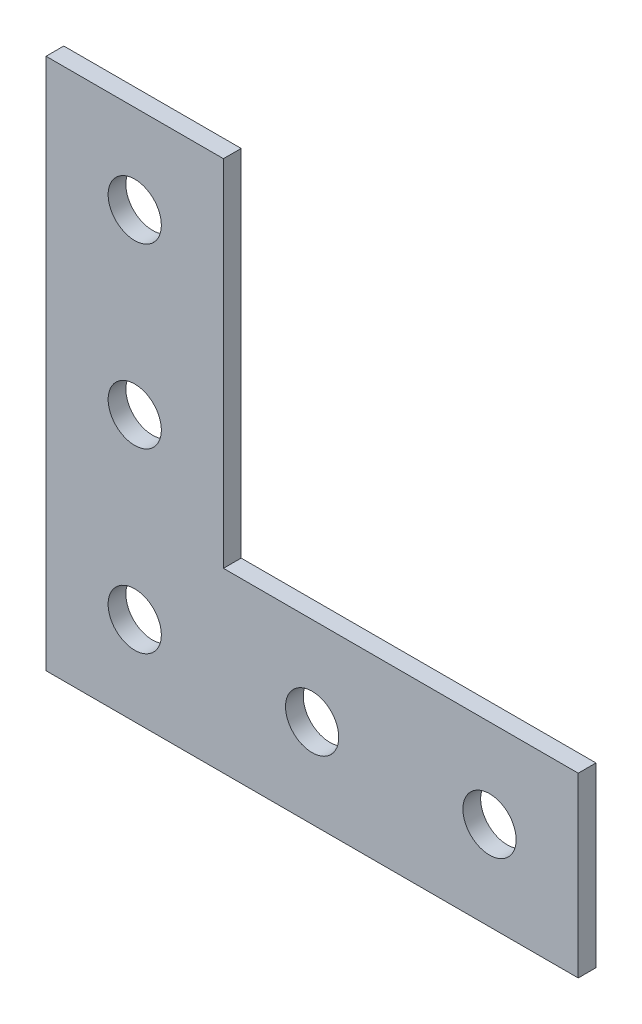
ISO-10303-21;
HEADER;
FILE_DESCRIPTION(('STEP AP214'),'2;1');
FILE_NAME('part.step','',(''),(''),'','','');
FILE_SCHEMA(('AUTOMOTIVE_DESIGN { 1 0 10303 214 1 1 1 1 }'));
ENDSEC;
DATA;
#1=APPLICATION_CONTEXT('core data for automotive mechanical design processes');
#2=APPLICATION_PROTOCOL_DEFINITION('international standard','automotive_design',2000,#1);
#3=PRODUCT_CONTEXT('',#1,'mechanical');
#4=PRODUCT('Part','Part','',(#3));
#5=PRODUCT_RELATED_PRODUCT_CATEGORY('part','',(#4));
#6=PRODUCT_DEFINITION_FORMATION('','',#4);
#7=PRODUCT_DEFINITION_CONTEXT('part definition',#1,'design');
#8=PRODUCT_DEFINITION('design','',#6,#7);
#9=PRODUCT_DEFINITION_SHAPE('','',#8);
#10=(LENGTH_UNIT() NAMED_UNIT(*) SI_UNIT(.MILLI.,.METRE.));
#11=(NAMED_UNIT(*) PLANE_ANGLE_UNIT() SI_UNIT($,.RADIAN.));
#12=(NAMED_UNIT(*) SI_UNIT($,.STERADIAN.) SOLID_ANGLE_UNIT());
#13=UNCERTAINTY_MEASURE_WITH_UNIT(LENGTH_MEASURE(1.E-05),#10,'distance_accuracy_value','');
#14=(GEOMETRIC_REPRESENTATION_CONTEXT(3) GLOBAL_UNCERTAINTY_ASSIGNED_CONTEXT((#13)) GLOBAL_UNIT_ASSIGNED_CONTEXT((#10,
#11,#12)) REPRESENTATION_CONTEXT('',''));
#15=CARTESIAN_POINT('',(0.,0.,0.));
#16=DIRECTION('',(0.,0.,1.));
#17=DIRECTION('',(1.,0.,0.));
#18=AXIS2_PLACEMENT_3D('',#15,#16,#17);
#19=CARTESIAN_POINT('',(0.,30.,1.));
#20=DIRECTION('',(1.,0.,0.));
#21=DIRECTION('',(0.,0.,-1.));
#22=AXIS2_PLACEMENT_3D('',#19,#20,#21);
#23=PLANE('',#22);
#24=DIRECTION('',(0.,-1.,0.));
#25=VECTOR('',#24,1.);
#26=CARTESIAN_POINT('',(0.,30.,0.));
#27=LINE('',#26,#25);
#28=CARTESIAN_POINT('',(0.,30.,0.));
#29=VERTEX_POINT('',#28);
#30=CARTESIAN_POINT('',(0.,0.,0.));
#31=VERTEX_POINT('',#30);
#32=EDGE_CURVE('E117',#29,#31,#27,.T.);
#33=ORIENTED_EDGE('',*,*,#32,.T.);
#34=DIRECTION('',(0.,0.,-1.));
#35=VECTOR('',#34,1.);
#36=CARTESIAN_POINT('',(0.,0.,1.));
#37=LINE('',#36,#35);
#38=CARTESIAN_POINT('',(0.,0.,1.));
#39=VERTEX_POINT('',#38);
#40=EDGE_CURVE('E11',#39,#31,#37,.T.);
#41=ORIENTED_EDGE('',*,*,#40,.F.);
#42=DIRECTION('',(0.,-1.,0.));
#43=VECTOR('',#42,1.);
#44=CARTESIAN_POINT('',(0.,30.,1.));
#45=LINE('',#44,#43);
#46=CARTESIAN_POINT('',(0.,30.,1.));
#47=VERTEX_POINT('',#46);
#48=EDGE_CURVE('E128',#47,#39,#45,.T.);
#49=ORIENTED_EDGE('',*,*,#48,.F.);
#50=DIRECTION('',(0.,0.,-1.));
#51=VECTOR('',#50,1.);
#52=CARTESIAN_POINT('',(0.,30.,1.));
#53=LINE('',#52,#51);
#54=EDGE_CURVE('E113',#47,#29,#53,.T.);
#55=ORIENTED_EDGE('',*,*,#54,.T.);
#56=EDGE_LOOP('',(#33,#41,#49,#55));
#57=FACE_BOUND('',#56,.T.);
#58=ADVANCED_FACE('F33',(#57),#23,.F.);
#59=CARTESIAN_POINT('',(0.,0.,1.));
#60=DIRECTION('',(0.,1.,0.));
#61=DIRECTION('',(-1.,0.,0.));
#62=AXIS2_PLACEMENT_3D('',#59,#60,#61);
#63=PLANE('',#62);
#64=DIRECTION('',(1.,0.,0.));
#65=VECTOR('',#64,1.);
#66=CARTESIAN_POINT('',(0.,0.,0.));
#67=LINE('',#66,#65);
#68=CARTESIAN_POINT('',(30.,0.,0.));
#69=VERTEX_POINT('',#68);
#70=EDGE_CURVE('E120',#31,#69,#67,.T.);
#71=ORIENTED_EDGE('',*,*,#70,.T.);
#72=DIRECTION('',(0.,0.,-1.));
#73=VECTOR('',#72,1.);
#74=CARTESIAN_POINT('',(30.,0.,1.));
#75=LINE('',#74,#73);
#76=CARTESIAN_POINT('',(30.,0.,1.));
#77=VERTEX_POINT('',#76);
#78=EDGE_CURVE('E41',#77,#69,#75,.T.);
#79=ORIENTED_EDGE('',*,*,#78,.F.);
#80=DIRECTION('',(1.,0.,0.));
#81=VECTOR('',#80,1.);
#82=CARTESIAN_POINT('',(0.,0.,1.));
#83=LINE('',#82,#81);
#84=EDGE_CURVE('E86',#39,#77,#83,.T.);
#85=ORIENTED_EDGE('',*,*,#84,.F.);
#86=ORIENTED_EDGE('',*,*,#40,.T.);
#87=EDGE_LOOP('',(#71,#79,#85,#86));
#88=FACE_BOUND('',#87,.T.);
#89=ADVANCED_FACE('F153',(#88),#63,.F.);
#90=CARTESIAN_POINT('',(30.,0.,1.));
#91=DIRECTION('',(-1.,0.,0.));
#92=DIRECTION('',(0.,0.,1.));
#93=AXIS2_PLACEMENT_3D('',#90,#91,#92);
#94=PLANE('',#93);
#95=DIRECTION('',(0.,1.,0.));
#96=VECTOR('',#95,1.);
#97=CARTESIAN_POINT('',(30.,0.,0.));
#98=LINE('',#97,#96);
#99=CARTESIAN_POINT('',(30.,10.,0.));
#100=VERTEX_POINT('',#99);
#101=EDGE_CURVE('E123',#69,#100,#98,.T.);
#102=ORIENTED_EDGE('',*,*,#101,.T.);
#103=DIRECTION('',(0.,0.,-1.));
#104=VECTOR('',#103,1.);
#105=CARTESIAN_POINT('',(30.,10.,1.));
#106=LINE('',#105,#104);
#107=CARTESIAN_POINT('',(30.,10.,1.));
#108=VERTEX_POINT('',#107);
#109=EDGE_CURVE('E108',#108,#100,#106,.T.);
#110=ORIENTED_EDGE('',*,*,#109,.F.);
#111=DIRECTION('',(0.,1.,0.));
#112=VECTOR('',#111,1.);
#113=CARTESIAN_POINT('',(30.,0.,1.));
#114=LINE('',#113,#112);
#115=EDGE_CURVE('E99',#77,#108,#114,.T.);
#116=ORIENTED_EDGE('',*,*,#115,.F.);
#117=ORIENTED_EDGE('',*,*,#78,.T.);
#118=EDGE_LOOP('',(#102,#110,#116,#117));
#119=FACE_BOUND('',#118,.T.);
#120=ADVANCED_FACE('F134',(#119),#94,.F.);
#121=CARTESIAN_POINT('',(30.,10.,1.));
#122=DIRECTION('',(0.,-1.,0.));
#123=DIRECTION('',(0.,0.,-1.));
#124=AXIS2_PLACEMENT_3D('',#121,#122,#123);
#125=PLANE('',#124);
#126=DIRECTION('',(-1.,0.,0.));
#127=VECTOR('',#126,1.);
#128=CARTESIAN_POINT('',(30.,10.,0.));
#129=LINE('',#128,#127);
#130=CARTESIAN_POINT('',(10.,10.,0.));
#131=VERTEX_POINT('',#130);
#132=EDGE_CURVE('E107',#100,#131,#129,.T.);
#133=ORIENTED_EDGE('',*,*,#132,.T.);
#134=DIRECTION('',(0.,0.,-1.));
#135=VECTOR('',#134,1.);
#136=CARTESIAN_POINT('',(10.,10.,1.));
#137=LINE('',#136,#135);
#138=CARTESIAN_POINT('',(10.,10.,1.));
#139=VERTEX_POINT('',#138);
#140=EDGE_CURVE('E104',#139,#131,#137,.T.);
#141=ORIENTED_EDGE('',*,*,#140,.F.);
#142=DIRECTION('',(-1.,0.,0.));
#143=VECTOR('',#142,1.);
#144=CARTESIAN_POINT('',(30.,10.,1.));
#145=LINE('',#144,#143);
#146=EDGE_CURVE('E93',#108,#139,#145,.T.);
#147=ORIENTED_EDGE('',*,*,#146,.F.);
#148=ORIENTED_EDGE('',*,*,#109,.T.);
#149=EDGE_LOOP('',(#133,#141,#147,#148));
#150=FACE_BOUND('',#149,.T.);
#151=ADVANCED_FACE('F105',(#150),#125,.F.);
#152=CARTESIAN_POINT('',(10.,10.,1.));
#153=DIRECTION('',(-1.,0.,0.));
#154=DIRECTION('',(0.,0.,1.));
#155=AXIS2_PLACEMENT_3D('',#152,#153,#154);
#156=PLANE('',#155);
#157=DIRECTION('',(0.,1.,0.));
#158=VECTOR('',#157,1.);
#159=CARTESIAN_POINT('',(10.,10.,0.));
#160=LINE('',#159,#158);
#161=CARTESIAN_POINT('',(10.,30.,0.));
#162=VERTEX_POINT('',#161);
#163=EDGE_CURVE('E72',#131,#162,#160,.T.);
#164=ORIENTED_EDGE('',*,*,#163,.T.);
#165=DIRECTION('',(0.,0.,-1.));
#166=VECTOR('',#165,1.);
#167=CARTESIAN_POINT('',(10.,30.,1.));
#168=LINE('',#167,#166);
#169=CARTESIAN_POINT('',(10.,30.,1.));
#170=VERTEX_POINT('',#169);
#171=EDGE_CURVE('E109',#170,#162,#168,.T.);
#172=ORIENTED_EDGE('',*,*,#171,.F.);
#173=DIRECTION('',(0.,1.,0.));
#174=VECTOR('',#173,1.);
#175=CARTESIAN_POINT('',(10.,10.,1.));
#176=LINE('',#175,#174);
#177=EDGE_CURVE('E97',#139,#170,#176,.T.);
#178=ORIENTED_EDGE('',*,*,#177,.F.);
#179=ORIENTED_EDGE('',*,*,#140,.T.);
#180=EDGE_LOOP('',(#164,#172,#178,#179));
#181=FACE_BOUND('',#180,.T.);
#182=ADVANCED_FACE('F111',(#181),#156,.F.);
#183=CARTESIAN_POINT('',(10.,30.,1.));
#184=DIRECTION('',(0.,-1.,0.));
#185=DIRECTION('',(0.,0.,-1.));
#186=AXIS2_PLACEMENT_3D('',#183,#184,#185);
#187=PLANE('',#186);
#188=DIRECTION('',(-1.,0.,0.));
#189=VECTOR('',#188,1.);
#190=CARTESIAN_POINT('',(10.,30.,0.));
#191=LINE('',#190,#189);
#192=EDGE_CURVE('E78',#162,#29,#191,.T.);
#193=ORIENTED_EDGE('',*,*,#192,.T.);
#194=ORIENTED_EDGE('',*,*,#54,.F.);
#195=DIRECTION('',(-1.,0.,0.));
#196=VECTOR('',#195,1.);
#197=CARTESIAN_POINT('',(10.,30.,1.));
#198=LINE('',#197,#196);
#199=EDGE_CURVE('E49',#170,#47,#198,.T.);
#200=ORIENTED_EDGE('',*,*,#199,.F.);
#201=ORIENTED_EDGE('',*,*,#171,.T.);
#202=EDGE_LOOP('',(#193,#194,#200,#201));
#203=FACE_BOUND('',#202,.T.);
#204=ADVANCED_FACE('F141',(#203),#187,.F.);
#205=CARTESIAN_POINT('',(0.,0.,1.));
#206=DIRECTION('',(0.,0.,1.));
#207=DIRECTION('',(1.,0.,0.));
#208=AXIS2_PLACEMENT_3D('',#205,#206,#207);
#209=PLANE('',#208);
#210=CARTESIAN_POINT('',(5.,25.,1.));
#211=DIRECTION('',(0.,0.,1.));
#212=DIRECTION('',(1.,0.,0.));
#213=AXIS2_PLACEMENT_3D('',#210,#211,#212);
#214=CIRCLE('',#213,1.5);
#215=CARTESIAN_POINT('',(6.5,25.,1.));
#216=VERTEX_POINT('',#215);
#217=EDGE_CURVE('E249',#216,#216,#214,.T.);
#218=ORIENTED_EDGE('',*,*,#217,.F.);
#219=EDGE_LOOP('',(#218));
#220=FACE_BOUND('',#219,.T.);
#221=CARTESIAN_POINT('',(5.,15.,1.));
#222=DIRECTION('',(0.,0.,1.));
#223=DIRECTION('',(1.,0.,0.));
#224=AXIS2_PLACEMENT_3D('',#221,#222,#223);
#225=CIRCLE('',#224,1.5);
#226=CARTESIAN_POINT('',(6.5,15.,1.));
#227=VERTEX_POINT('',#226);
#228=EDGE_CURVE('E255',#227,#227,#225,.T.);
#229=ORIENTED_EDGE('',*,*,#228,.F.);
#230=EDGE_LOOP('',(#229));
#231=FACE_BOUND('',#230,.T.);
#232=CARTESIAN_POINT('',(15.,5.,1.));
#233=DIRECTION('',(0.,0.,1.));
#234=DIRECTION('',(1.,0.,0.));
#235=AXIS2_PLACEMENT_3D('',#232,#233,#234);
#236=CIRCLE('',#235,1.5);
#237=CARTESIAN_POINT('',(16.5,5.,1.));
#238=VERTEX_POINT('',#237);
#239=EDGE_CURVE('E263',#238,#238,#236,.T.);
#240=ORIENTED_EDGE('',*,*,#239,.F.);
#241=EDGE_LOOP('',(#240));
#242=FACE_BOUND('',#241,.T.);
#243=CARTESIAN_POINT('',(25.,5.,1.));
#244=DIRECTION('',(0.,0.,1.));
#245=DIRECTION('',(1.,0.,0.));
#246=AXIS2_PLACEMENT_3D('',#243,#244,#245);
#247=CIRCLE('',#246,1.5);
#248=CARTESIAN_POINT('',(26.5,5.,1.));
#249=VERTEX_POINT('',#248);
#250=EDGE_CURVE('E269',#249,#249,#247,.T.);
#251=ORIENTED_EDGE('',*,*,#250,.F.);
#252=EDGE_LOOP('',(#251));
#253=FACE_BOUND('',#252,.T.);
#254=CARTESIAN_POINT('',(5.,5.,1.));
#255=DIRECTION('',(0.,0.,1.));
#256=DIRECTION('',(1.,0.,0.));
#257=AXIS2_PLACEMENT_3D('',#254,#255,#256);
#258=CIRCLE('',#257,1.5);
#259=CARTESIAN_POINT('',(6.5,5.,1.));
#260=VERTEX_POINT('',#259);
#261=EDGE_CURVE('E252',#260,#260,#258,.T.);
#262=ORIENTED_EDGE('',*,*,#261,.F.);
#263=EDGE_LOOP('',(#262));
#264=FACE_BOUND('',#263,.T.);
#265=ORIENTED_EDGE('',*,*,#48,.T.);
#266=ORIENTED_EDGE('',*,*,#84,.T.);
#267=ORIENTED_EDGE('',*,*,#115,.T.);
#268=ORIENTED_EDGE('',*,*,#146,.T.);
#269=ORIENTED_EDGE('',*,*,#177,.T.);
#270=ORIENTED_EDGE('',*,*,#199,.T.);
#271=EDGE_LOOP('',(#265,#266,#267,#268,#269,#270));
#272=FACE_BOUND('',#271,.T.);
#273=ADVANCED_FACE('F95',(#220,#231,#242,#253,#264,#272),#209,.T.);
#274=CARTESIAN_POINT('',(0.,0.,0.));
#275=DIRECTION('',(0.,0.,1.));
#276=DIRECTION('',(1.,0.,0.));
#277=AXIS2_PLACEMENT_3D('',#274,#275,#276);
#278=PLANE('',#277);
#279=CARTESIAN_POINT('',(5.,25.,0.));
#280=DIRECTION('',(0.,0.,1.));
#281=DIRECTION('',(1.,0.,0.));
#282=AXIS2_PLACEMENT_3D('',#279,#280,#281);
#283=CIRCLE('',#282,1.5);
#284=CARTESIAN_POINT('',(6.5,25.,0.));
#285=VERTEX_POINT('',#284);
#286=EDGE_CURVE('E246',#285,#285,#283,.T.);
#287=ORIENTED_EDGE('',*,*,#286,.T.);
#288=EDGE_LOOP('',(#287));
#289=FACE_BOUND('',#288,.T.);
#290=CARTESIAN_POINT('',(5.,15.,0.));
#291=DIRECTION('',(0.,0.,1.));
#292=DIRECTION('',(1.,0.,0.));
#293=AXIS2_PLACEMENT_3D('',#290,#291,#292);
#294=CIRCLE('',#293,1.5);
#295=CARTESIAN_POINT('',(6.5,15.,0.));
#296=VERTEX_POINT('',#295);
#297=EDGE_CURVE('E250',#296,#296,#294,.T.);
#298=ORIENTED_EDGE('',*,*,#297,.T.);
#299=EDGE_LOOP('',(#298));
#300=FACE_BOUND('',#299,.T.);
#301=CARTESIAN_POINT('',(15.,5.,0.));
#302=DIRECTION('',(0.,0.,1.));
#303=DIRECTION('',(1.,0.,0.));
#304=AXIS2_PLACEMENT_3D('',#301,#302,#303);
#305=CIRCLE('',#304,1.5);
#306=CARTESIAN_POINT('',(16.5,5.,0.));
#307=VERTEX_POINT('',#306);
#308=EDGE_CURVE('E260',#307,#307,#305,.T.);
#309=ORIENTED_EDGE('',*,*,#308,.T.);
#310=EDGE_LOOP('',(#309));
#311=FACE_BOUND('',#310,.T.);
#312=CARTESIAN_POINT('',(25.,5.,0.));
#313=DIRECTION('',(0.,0.,1.));
#314=DIRECTION('',(1.,0.,0.));
#315=AXIS2_PLACEMENT_3D('',#312,#313,#314);
#316=CIRCLE('',#315,1.5);
#317=CARTESIAN_POINT('',(26.5,5.,0.));
#318=VERTEX_POINT('',#317);
#319=EDGE_CURVE('E266',#318,#318,#316,.T.);
#320=ORIENTED_EDGE('',*,*,#319,.T.);
#321=EDGE_LOOP('',(#320));
#322=FACE_BOUND('',#321,.T.);
#323=CARTESIAN_POINT('',(5.,5.,0.));
#324=DIRECTION('',(0.,0.,1.));
#325=DIRECTION('',(1.,0.,0.));
#326=AXIS2_PLACEMENT_3D('',#323,#324,#325);
#327=CIRCLE('',#326,1.5);
#328=CARTESIAN_POINT('',(6.5,5.,0.));
#329=VERTEX_POINT('',#328);
#330=EDGE_CURVE('E121',#329,#329,#327,.T.);
#331=ORIENTED_EDGE('',*,*,#330,.T.);
#332=EDGE_LOOP('',(#331));
#333=FACE_BOUND('',#332,.T.);
#334=ORIENTED_EDGE('',*,*,#32,.F.);
#335=ORIENTED_EDGE('',*,*,#192,.F.);
#336=ORIENTED_EDGE('',*,*,#163,.F.);
#337=ORIENTED_EDGE('',*,*,#132,.F.);
#338=ORIENTED_EDGE('',*,*,#101,.F.);
#339=ORIENTED_EDGE('',*,*,#70,.F.);
#340=EDGE_LOOP('',(#334,#335,#336,#337,#338,#339));
#341=FACE_BOUND('',#340,.T.);
#342=ADVANCED_FACE('F137',(#289,#300,#311,#322,#333,#341),#278,.F.);
#343=CARTESIAN_POINT('',(5.,5.,0.));
#344=DIRECTION('',(0.,0.,1.));
#345=DIRECTION('',(1.,0.,0.));
#346=AXIS2_PLACEMENT_3D('',#343,#344,#345);
#347=CYLINDRICAL_SURFACE('',#346,1.5);
#348=ORIENTED_EDGE('',*,*,#330,.F.);
#349=EDGE_LOOP('',(#348));
#350=FACE_BOUND('',#349,.T.);
#351=ORIENTED_EDGE('',*,*,#261,.T.);
#352=EDGE_LOOP('',(#351));
#353=FACE_BOUND('',#352,.T.);
#354=ADVANCED_FACE('F190',(#350,#353),#347,.F.);
#355=CARTESIAN_POINT('',(25.,5.,0.));
#356=DIRECTION('',(0.,0.,1.));
#357=DIRECTION('',(1.,0.,0.));
#358=AXIS2_PLACEMENT_3D('',#355,#356,#357);
#359=CYLINDRICAL_SURFACE('',#358,1.5);
#360=ORIENTED_EDGE('',*,*,#319,.F.);
#361=EDGE_LOOP('',(#360));
#362=FACE_BOUND('',#361,.T.);
#363=ORIENTED_EDGE('',*,*,#250,.T.);
#364=EDGE_LOOP('',(#363));
#365=FACE_BOUND('',#364,.T.);
#366=ADVANCED_FACE('F199',(#362,#365),#359,.F.);
#367=CARTESIAN_POINT('',(15.,5.,0.));
#368=DIRECTION('',(0.,0.,1.));
#369=DIRECTION('',(1.,0.,0.));
#370=AXIS2_PLACEMENT_3D('',#367,#368,#369);
#371=CYLINDRICAL_SURFACE('',#370,1.5);
#372=ORIENTED_EDGE('',*,*,#308,.F.);
#373=EDGE_LOOP('',(#372));
#374=FACE_BOUND('',#373,.T.);
#375=ORIENTED_EDGE('',*,*,#239,.T.);
#376=EDGE_LOOP('',(#375));
#377=FACE_BOUND('',#376,.T.);
#378=ADVANCED_FACE('F209',(#374,#377),#371,.F.);
#379=CARTESIAN_POINT('',(5.,15.,0.));
#380=DIRECTION('',(0.,0.,1.));
#381=DIRECTION('',(1.,0.,0.));
#382=AXIS2_PLACEMENT_3D('',#379,#380,#381);
#383=CYLINDRICAL_SURFACE('',#382,1.5);
#384=ORIENTED_EDGE('',*,*,#297,.F.);
#385=EDGE_LOOP('',(#384));
#386=FACE_BOUND('',#385,.T.);
#387=ORIENTED_EDGE('',*,*,#228,.T.);
#388=EDGE_LOOP('',(#387));
#389=FACE_BOUND('',#388,.T.);
#390=ADVANCED_FACE('F219',(#386,#389),#383,.F.);
#391=CARTESIAN_POINT('',(5.,25.,0.));
#392=DIRECTION('',(0.,0.,1.));
#393=DIRECTION('',(1.,0.,0.));
#394=AXIS2_PLACEMENT_3D('',#391,#392,#393);
#395=CYLINDRICAL_SURFACE('',#394,1.5);
#396=ORIENTED_EDGE('',*,*,#286,.F.);
#397=EDGE_LOOP('',(#396));
#398=FACE_BOUND('',#397,.T.);
#399=ORIENTED_EDGE('',*,*,#217,.T.);
#400=EDGE_LOOP('',(#399));
#401=FACE_BOUND('',#400,.T.);
#402=ADVANCED_FACE('F229',(#398,#401),#395,.F.);
#403=CLOSED_SHELL('',(#58,#89,#120,#151,#182,#204,#273,#342,#354,#366,#378,#390,#402));
#404=MANIFOLD_SOLID_BREP('B2',#403);
#405=ADVANCED_BREP_SHAPE_REPRESENTATION('',(#18,#404),#14);
#406=SHAPE_DEFINITION_REPRESENTATION(#9,#405);
ENDSEC;
END-ISO-10303-21;
